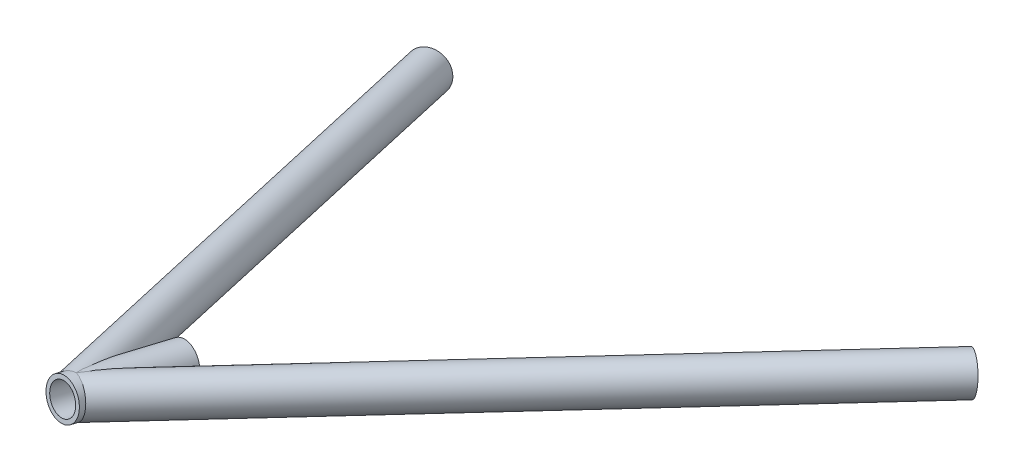
ISO-10303-21;
HEADER;
FILE_DESCRIPTION(('STEP AP214'),'2;1');
FILE_NAME('part.step','',(''),(''),'','','');
FILE_SCHEMA(('AUTOMOTIVE_DESIGN { 1 0 10303 214 1 1 1 1 }'));
ENDSEC;
DATA;
#1=APPLICATION_CONTEXT('core data for automotive mechanical design processes');
#2=APPLICATION_PROTOCOL_DEFINITION('international standard','automotive_design',2000,#1);
#3=PRODUCT_CONTEXT('',#1,'mechanical');
#4=PRODUCT('Part','Part','',(#3));
#5=PRODUCT_RELATED_PRODUCT_CATEGORY('part','',(#4));
#6=PRODUCT_DEFINITION_FORMATION('','',#4);
#7=PRODUCT_DEFINITION_CONTEXT('part definition',#1,'design');
#8=PRODUCT_DEFINITION('design','',#6,#7);
#9=PRODUCT_DEFINITION_SHAPE('','',#8);
#10=(LENGTH_UNIT() NAMED_UNIT(*) SI_UNIT(.MILLI.,.METRE.));
#11=(NAMED_UNIT(*) PLANE_ANGLE_UNIT() SI_UNIT($,.RADIAN.));
#12=(NAMED_UNIT(*) SI_UNIT($,.STERADIAN.) SOLID_ANGLE_UNIT());
#13=UNCERTAINTY_MEASURE_WITH_UNIT(LENGTH_MEASURE(1.E-05),#10,'distance_accuracy_value','');
#14=(GEOMETRIC_REPRESENTATION_CONTEXT(3) GLOBAL_UNCERTAINTY_ASSIGNED_CONTEXT((#13)) GLOBAL_UNIT_ASSIGNED_CONTEXT((#10,
#11,#12)) REPRESENTATION_CONTEXT('',''));
#15=CARTESIAN_POINT('',(0.,0.,0.));
#16=DIRECTION('',(0.,0.,1.));
#17=DIRECTION('',(1.,0.,0.));
#18=AXIS2_PLACEMENT_3D('',#15,#16,#17);
#19=CARTESIAN_POINT('',(4.04397858951075,301.981612494775,650.872201759846));
#20=DIRECTION('',(0.537160814672258,-0.118768279923982,-0.835076256915819));
#21=DIRECTION('',(-0.841029061630512,0.,-0.540989942136544));
#22=AXIS2_PLACEMENT_3D('',#19,#20,#21);
#23=CYLINDRICAL_SURFACE('',#22,7.41679999999997);
#24=CARTESIAN_POINT('',(181.199371486471,262.811887676954,375.464431215176));
#25=DIRECTION('',(-0.537160814672258,0.118768279923982,0.835076256915819));
#26=DIRECTION('',(0.841029061630512,0.,0.540989942136543));
#27=AXIS2_PLACEMENT_3D('',#24,#25,#26);
#28=CIRCLE('',#27,7.41679999999997);
#29=CARTESIAN_POINT('',(187.437115830772,262.811887676954,379.476845418014));
#30=VERTEX_POINT('',#29);
#31=EDGE_CURVE('E107',#30,#30,#28,.T.);
#32=ORIENTED_EDGE('',*,*,#31,.F.);
#33=EDGE_LOOP('',(#32));
#34=FACE_BOUND('',#33,.T.);
#35=CARTESIAN_POINT('',(18.0259893730203,297.510948456335,615.425928335186));
#36=CARTESIAN_POINT('',(18.0392009230547,297.391181249334,615.4053989557));
#37=CARTESIAN_POINT('',(18.049379106641,297.269192682269,615.394643104518));
#38=CARTESIAN_POINT('',(18.0623771955097,297.024848893247,615.395952968748));
#39=CARTESIAN_POINT('',(18.06519601463,296.902493619836,615.408022052419));
#40=CARTESIAN_POINT('',(18.0631446437854,296.662477211055,615.455138321569));
#41=CARTESIAN_POINT('',(18.0582796529336,296.544812956811,615.490169960463));
#42=CARTESIAN_POINT('',(18.0416756858454,296.317868608693,615.58008254422));
#43=CARTESIAN_POINT('',(18.0299260387503,296.208601828507,615.634994251557));
#44=CARTESIAN_POINT('',(17.9965826357287,295.968773124247,615.778938372833));
#45=CARTESIAN_POINT('',(17.9730897345507,295.841710660102,615.873266291217));
#46=CARTESIAN_POINT('',(17.9197422240915,295.603899976413,616.078980624299));
#47=CARTESIAN_POINT('',(17.8898736862353,295.493188388632,616.190404234864));
#48=CARTESIAN_POINT('',(17.8275120366974,295.291093662526,616.418282505348));
#49=CARTESIAN_POINT('',(17.7952315748672,295.199011169215,616.534187563074));
#50=CARTESIAN_POINT('',(17.7279462334323,295.025261820128,616.772888114363));
#51=CARTESIAN_POINT('',(17.692938744839,294.943605140931,616.895690174271));
#52=CARTESIAN_POINT('',(17.620894661041,294.788818403219,617.146389147038));
#53=CARTESIAN_POINT('',(17.5838530632472,294.715710889433,617.274298388449));
#54=CARTESIAN_POINT('',(17.5083523726395,294.576878159229,617.53354024883));
#55=CARTESIAN_POINT('',(17.4698939088278,294.511149718176,617.664871341302));
#56=CARTESIAN_POINT('',(17.3656042528833,294.343650096037,618.019563112275));
#57=CARTESIAN_POINT('',(17.298801180808,294.24745909781,618.24526830367));
#58=CARTESIAN_POINT('',(17.1632389097918,294.068548963037,618.701432507359));
#59=CARTESIAN_POINT('',(17.0944785846952,293.985837774328,618.931894234593));
#60=CARTESIAN_POINT('',(16.9555367997195,293.831169639357,619.396480467915));
#61=CARTESIAN_POINT('',(16.8853528544155,293.759233744994,619.630611181744));
#62=CARTESIAN_POINT('',(16.7441163542546,293.624403841432,620.101208439363));
#63=CARTESIAN_POINT('',(16.6730636982798,293.561510895916,620.337675254449));
#64=CARTESIAN_POINT('',(16.5300291670172,293.443074322862,620.813551004494));
#65=CARTESIAN_POINT('',(16.458044393262,293.387570110842,621.052968813209));
#66=CARTESIAN_POINT('',(16.3137273383495,293.28322583845,621.53314758715));
#67=CARTESIAN_POINT('',(16.2413950423059,293.234386066235,621.773908609987));
#68=CARTESIAN_POINT('',(16.0243304399387,293.096696071643,622.497142697111));
#69=CARTESIAN_POINT('',(15.8793409293532,293.016523891741,622.981195597616));
#70=CARTESIAN_POINT('',(15.563202463854,292.861599362073,624.040978545665));
#71=CARTESIAN_POINT('',(15.3921278067244,292.790531373747,624.617256246227));
#72=CARTESIAN_POINT('',(15.0517610779049,292.669278219643,625.772592750415));
#73=CARTESIAN_POINT('',(14.8824693232943,292.619096709261,626.351652022929));
#74=CARTESIAN_POINT('',(14.546667293014,292.536462920992,627.512621813292));
#75=CARTESIAN_POINT('',(14.3801608537045,292.504033411516,628.094535031451));
#76=CARTESIAN_POINT('',(14.051431917114,292.454994085379,629.260174503447));
#77=CARTESIAN_POINT('',(13.8892090857078,292.4383830313,629.843900611884));
#78=CARTESIAN_POINT('',(13.5711219110217,292.419823964543,631.010997751313));
#79=CARTESIAN_POINT('',(13.4152362896875,292.417822003584,631.594362126013));
#80=CARTESIAN_POINT('',(13.1110723780713,292.427863543567,632.763005472116));
#81=CARTESIAN_POINT('',(12.962794721003,292.439908211642,633.348284598584));
#82=CARTESIAN_POINT('',(12.6765234996167,292.478257381376,634.520275832957));
#83=CARTESIAN_POINT('',(12.5385193019929,292.504546899102,635.106985791365));
#84=CARTESIAN_POINT('',(12.3417938870989,292.555556279288,635.988619697626));
#85=CARTESIAN_POINT('',(12.277936128261,292.574486948643,636.282739578099));
#86=CARTESIAN_POINT('',(12.1542433083895,292.616487327866,636.871525918635));
#87=CARTESIAN_POINT('',(12.0944081591793,292.639556946967,637.166192366571));
#88=CARTESIAN_POINT('',(11.9600289486346,292.698749171385,637.85572611667));
#89=CARTESIAN_POINT('',(11.8873456926771,292.736648454893,638.250810467152));
#90=CARTESIAN_POINT('',(11.7525274778548,292.821778631757,639.041866355432));
#91=CARTESIAN_POINT('',(11.6903943502096,292.869011142037,639.437838035187));
#92=CARTESIAN_POINT('',(11.5794750694732,292.974727860035,640.230313522759));
#93=CARTESIAN_POINT('',(11.5306913396657,293.033214107339,640.626817414077));
#94=CARTESIAN_POINT('',(11.470343554994,293.131539272535,641.221076182981));
#95=CARTESIAN_POINT('',(11.4523665530691,293.166076993828,641.419063215714));
#96=CARTESIAN_POINT('',(11.4212609410856,293.239185884249,641.814667454382));
#97=CARTESIAN_POINT('',(11.4081320379369,293.27775680937,642.012284681955));
#98=CARTESIAN_POINT('',(11.3836671576796,293.373983487733,642.476735145353));
#99=CARTESIAN_POINT('',(11.3746116949344,293.433561302975,642.743302696478));
#100=CARTESIAN_POINT('',(11.3682948089143,293.562972324594,643.274164444859));
#101=CARTESIAN_POINT('',(11.3710346788846,293.632806654688,643.538458389653));
#102=CARTESIAN_POINT('',(11.3901826404233,293.784818610712,644.062448751672));
#103=CARTESIAN_POINT('',(11.4065623411157,293.866970307445,644.322153575299));
#104=CARTESIAN_POINT('',(11.4547428616655,294.046367314067,644.834848924092));
#105=CARTESIAN_POINT('',(11.4865364051065,294.143605487367,645.087842558034));
#106=CARTESIAN_POINT('',(11.5549147493514,294.324768047379,645.510473998685));
#107=CARTESIAN_POINT('',(11.5873322808602,294.404182129703,645.682721295324));
#108=CARTESIAN_POINT('',(11.6604911919953,294.572921566891,646.020439354004));
#109=CARTESIAN_POINT('',(11.7012298817969,294.662243714708,646.18591228517));
#110=CARTESIAN_POINT('',(11.7906581033069,294.851549362705,646.508223893678));
#111=CARTESIAN_POINT('',(11.8393406372267,294.951523452854,646.665070009299));
#112=CARTESIAN_POINT('',(11.9438288702849,295.162741771333,646.968493413005));
#113=CARTESIAN_POINT('',(11.9996345085449,295.273985903342,647.115070788835));
#114=CARTESIAN_POINT('',(12.1173731324617,295.508672974601,647.39721363735));
#115=CARTESIAN_POINT('',(12.1793428592063,295.632189055164,647.532703077649));
#116=CARTESIAN_POINT('',(12.3072756051872,295.890609327443,647.790288659604));
#117=CARTESIAN_POINT('',(12.3732387464868,296.02551386731,647.912384391545));
#118=CARTESIAN_POINT('',(12.5071009026746,296.30622592416,648.14236901447));
#119=CARTESIAN_POINT('',(12.5750012948688,296.452041324178,648.250247475103));
#120=CARTESIAN_POINT('',(12.7105107236756,296.753620990599,648.451253342594));
#121=CARTESIAN_POINT('',(12.7781197686254,296.909384970267,648.54438117432));
#122=CARTESIAN_POINT('',(12.9053835786029,297.216345003063,648.708635413285));
#123=CARTESIAN_POINT('',(12.9652297478743,297.366827559972,648.780952279324));
#124=CARTESIAN_POINT('',(13.0814750650284,297.674352647588,648.913329403656));
#125=CARTESIAN_POINT('',(13.1378744622686,297.831394702358,648.973390549331));
#126=CARTESIAN_POINT('',(13.2459558550857,298.151114517152,649.081544727949));
#127=CARTESIAN_POINT('',(13.2976378372984,298.31379229314,649.129637726989));
#128=CARTESIAN_POINT('',(13.3952051458348,298.643841112701,649.214205400618));
#129=CARTESIAN_POINT('',(13.441090135971,298.811212427783,649.250679401568));
#130=CARTESIAN_POINT('',(13.5288574832356,299.160401496814,649.314323677058));
#131=CARTESIAN_POINT('',(13.5703029443316,299.342463296291,649.340759342042));
#132=CARTESIAN_POINT('',(13.6447657558027,299.70965408605,649.381328645444));
#133=CARTESIAN_POINT('',(13.6777828414342,299.894783172485,649.395461897466));
#134=CARTESIAN_POINT('',(13.7347467915508,300.26699078181,649.411812749685));
#135=CARTESIAN_POINT('',(13.758691794149,300.454069696784,649.414027905132));
#136=CARTESIAN_POINT('',(13.7970486877606,300.828982939074,649.406868787367));
#137=CARTESIAN_POINT('',(13.8114602965379,301.01681728859,649.397494171064));
#138=CARTESIAN_POINT('',(13.8309587333078,301.401581022214,649.366666461392));
#139=CARTESIAN_POINT('',(13.8355366740282,301.598489549477,649.34462604006));
#140=CARTESIAN_POINT('',(13.8337607085808,301.9905014218,649.288295516682));
#141=CARTESIAN_POINT('',(13.8274064049574,302.185604700969,649.254004969303));
#142=CARTESIAN_POINT('',(13.8038678608829,302.572672588593,649.173332003037));
#143=CARTESIAN_POINT('',(13.7866815731982,302.764636596692,649.126947299339));
#144=CARTESIAN_POINT('',(13.7417950399094,303.144007762921,649.022179296996));
#145=CARTESIAN_POINT('',(13.7140948250639,303.331414934382,648.963796033454));
#146=CARTESIAN_POINT('',(13.6483939375111,303.702122579301,648.834406375262));
#147=CARTESIAN_POINT('',(13.6102933945019,303.88536353833,648.76328001579));
#148=CARTESIAN_POINT('',(13.5247185082023,304.244338133499,648.608757825874));
#149=CARTESIAN_POINT('',(13.477244017158,304.420071651253,648.52536180204));
#150=CARTESIAN_POINT('',(13.373992291517,304.762569288793,648.346209796664));
#151=CARTESIAN_POINT('',(13.3182153847532,304.929333762381,648.250454303173));
#152=CARTESIAN_POINT('',(13.1997162137712,305.252448661401,648.046472659108));
#153=CARTESIAN_POINT('',(13.1369941772474,305.408799427974,647.938246917363));
#154=CARTESIAN_POINT('',(13.0079807472715,305.705736241056,647.712250351754));
#155=CARTESIAN_POINT('',(12.9418256091205,305.846627647483,647.59480319643));
#156=CARTESIAN_POINT('',(12.8063252704746,306.115959344151,647.348055863197));
#157=CARTESIAN_POINT('',(12.7369801487349,306.244399941537,647.218755977834));
#158=CARTESIAN_POINT('',(12.5972245605859,306.487624851574,646.948669395698));
#159=CARTESIAN_POINT('',(12.5268151987456,306.602422356299,646.807894020864));
#160=CARTESIAN_POINT('',(12.3870749633705,306.817660822114,646.515272129223));
#161=CARTESIAN_POINT('',(12.3177440058268,306.91810290655,646.363426480097));
#162=CARTESIAN_POINT('',(12.187204266398,307.097517916396,646.060748085196));
#163=CARTESIAN_POINT('',(12.1257689621684,307.177511507652,645.910616592422));
#164=CARTESIAN_POINT('',(12.0073617238849,307.324690296442,645.602541218296));
#165=CARTESIAN_POINT('',(11.9503894179186,307.391876561913,645.444597989707));
#166=CARTESIAN_POINT('',(11.8422612739717,307.513782780615,645.122088728321));
#167=CARTESIAN_POINT('',(11.7911047326352,307.568504242139,644.957523499652));
#168=CARTESIAN_POINT('',(11.6955621068052,307.666185719994,644.623031226127));
#169=CARTESIAN_POINT('',(11.6511769529345,307.709144120317,644.453103448139));
#170=CARTESIAN_POINT('',(11.5562273899794,307.796714592838,644.052034572754));
#171=CARTESIAN_POINT('',(11.508504229024,307.83714011634,643.819301773671));
#172=CARTESIAN_POINT('',(11.426372932171,307.901437123905,643.349259932401));
#173=CARTESIAN_POINT('',(11.3919700818443,307.925302039599,643.111949112764));
#174=CARTESIAN_POINT('',(11.3357964940907,307.959215673984,642.63434225165));
#175=CARTESIAN_POINT('',(11.3140562593375,307.96923111001,642.394040414363));
#176=CARTESIAN_POINT('',(11.2822138290264,307.977808650157,641.912553650223));
#177=CARTESIAN_POINT('',(11.2721103959542,307.97637197228,641.67136882001));
#178=CARTESIAN_POINT('',(11.2609650047204,307.9626033566,641.127982475222));
#179=CARTESIAN_POINT('',(11.2628654957441,307.947604593592,640.825795463397));
#180=CARTESIAN_POINT('',(11.2803047822254,307.906164362887,640.222546893591));
#181=CARTESIAN_POINT('',(11.2958500310743,307.879717483717,639.921485935857));
#182=CARTESIAN_POINT('',(11.3383398883103,307.817706795311,639.320600353298));
#183=CARTESIAN_POINT('',(11.3653050759216,307.782126573212,639.02077895199));
#184=CARTESIAN_POINT('',(11.4287010459255,307.703622419329,638.42318343931));
#185=CARTESIAN_POINT('',(11.4651303890478,307.660699604515,638.125409023702));
#186=CARTESIAN_POINT('',(11.5462096236828,307.568378875036,637.529410987154));
#187=CARTESIAN_POINT('',(11.5909257767127,307.518929765035,637.231204472079));
#188=CARTESIAN_POINT('',(11.6870548657426,307.414766469799,636.636803034188));
#189=CARTESIAN_POINT('',(11.7384679733657,307.360052149641,636.340608163129));
#190=CARTESIAN_POINT('',(11.8468591948296,307.24609197885,635.750486583504));
#191=CARTESIAN_POINT('',(11.9038308719929,307.186851386371,635.456557666955));
#192=CARTESIAN_POINT('',(12.0225233012161,307.064259457315,634.870528460908));
#193=CARTESIAN_POINT('',(12.0842440531249,307.000908120869,634.578428171352));
#194=CARTESIAN_POINT('',(12.2184611596817,306.863538311854,633.965181365808));
#195=CARTESIAN_POINT('',(12.2914069656672,306.789100061657,633.644227508919));
#196=CARTESIAN_POINT('',(12.441461988527,306.635913534411,633.004324054833));
#197=CARTESIAN_POINT('',(12.5185713428966,306.557165115023,632.685374524215));
#198=CARTESIAN_POINT('',(12.7551826990239,306.314740685158,631.731315983409));
#199=CARTESIAN_POINT('',(12.9199521729491,306.144901487568,631.099067891332));
#200=CARTESIAN_POINT('',(13.2599677612956,305.788975297079,629.840756650357));
#201=CARTESIAN_POINT('',(13.4352318327593,305.602860189012,629.214706369674));
#202=CARTESIAN_POINT('',(13.7932579710048,305.214016232643,627.970038393295));
#203=CARTESIAN_POINT('',(13.9760191405481,305.011289369524,627.351419819577));
#204=CARTESIAN_POINT('',(14.3452017680405,304.589678406339,626.128069053151));
#205=CARTESIAN_POINT('',(14.5315701650489,304.370971109374,625.523260275809));
#206=CARTESIAN_POINT('',(14.8139307637117,304.02745668686,624.6227274501));
#207=CARTESIAN_POINT('',(14.9085343518049,303.910356292052,624.323615826375));
#208=CARTESIAN_POINT('',(15.0984779122026,303.670518834585,623.727900343464));
#209=CARTESIAN_POINT('',(15.1938178634639,303.547781932507,623.431296413119));
#210=CARTESIAN_POINT('',(15.3848279575733,303.296351351947,622.841565050507));
#211=CARTESIAN_POINT('',(15.480496914537,303.167671355233,622.548431411254));
#212=CARTESIAN_POINT('',(15.6721587563683,302.903352225973,621.965436136662));
#213=CARTESIAN_POINT('',(15.7681516240351,302.767713457694,621.675574331022));
#214=CARTESIAN_POINT('',(15.9601786521053,302.488559756385,621.099861321316));
#215=CARTESIAN_POINT('',(16.0562127698196,302.345048680094,620.814008238013));
#216=CARTESIAN_POINT('',(16.2480657583436,302.048824611076,620.247057412478));
#217=CARTESIAN_POINT('',(16.3438846562762,301.896112854182,619.965959038063));
#218=CARTESIAN_POINT('',(16.5007724105263,301.636276128116,619.509191365899));
#219=CARTESIAN_POINT('',(16.5620197729741,301.532368346773,619.331752716318));
#220=CARTESIAN_POINT('',(16.6841330910256,301.31939311484,618.979814257614));
#221=CARTESIAN_POINT('',(16.7449989877478,301.210324888888,618.805314895497));
#222=CARTESIAN_POINT('',(16.8664289891661,300.98577901384,618.459144789293));
#223=CARTESIAN_POINT('',(16.9269904759811,300.870274557181,618.287490448721));
#224=CARTESIAN_POINT('',(17.0472615114838,300.63234713766,617.948769242178));
#225=CARTESIAN_POINT('',(17.1069712313438,300.509925590115,617.781701448066));
#226=CARTESIAN_POINT('',(17.2258774278961,300.25536827208,617.451488817069));
#227=CARTESIAN_POINT('',(17.2850595415654,300.123134945401,617.288413504024));
#228=CARTESIAN_POINT('',(17.4016610311343,299.848347429108,616.97013954836));
#229=CARTESIAN_POINT('',(17.4590786464364,299.705783379173,616.81494867798));
#230=CARTESIAN_POINT('',(17.5708662190597,299.408832466774,616.516614372798));
#231=CARTESIAN_POINT('',(17.6252497345914,299.254506976522,616.373415617786));
#232=CARTESIAN_POINT('',(17.7295842627494,298.930641743062,616.103831748072));
#233=CARTESIAN_POINT('',(17.7795458072694,298.761140196122,615.977406304535));
#234=CARTESIAN_POINT('',(17.86111838538,298.446195118441,615.777748005667));
#235=CARTESIAN_POINT('',(17.8942611916319,298.304685323759,615.69902386072));
#236=CARTESIAN_POINT('',(17.953971389663,298.010431036427,615.563990476506));
#237=CARTESIAN_POINT('',(17.9805769467949,297.857758849595,615.507549908532));
#238=CARTESIAN_POINT('',(18.0110423998854,297.638002947985,615.450592182051));
#239=CARTESIAN_POINT('',(18.0189468529607,297.574791302601,615.43687168146));
#240=CARTESIAN_POINT('',(18.0259893730203,297.510948456335,615.425928335186));
#241=B_SPLINE_CURVE_WITH_KNOTS('',3,(#35,#36,#37,#38,#39,#40,#41,#42,#43,#44,#45,#46,#47,#48,
#49,#50,#51,#52,#53,#54,#55,#56,#57,#58,#59,#60,#61,#62,#63,#64,#65,#66,#67,#68,#69,#70,#71,#72,
#73,#74,#75,#76,#77,#78,#79,#80,#81,#82,#83,#84,#85,#86,#87,#88,#89,#90,#91,#92,#93,#94,#95,#96,
#97,#98,#99,#100,#101,#102,#103,#104,#105,#106,#107,#108,#109,#110,#111,#112,#113,#114,#115,
#116,#117,#118,#119,#120,#121,#122,#123,#124,#125,#126,#127,#128,#129,#130,#131,#132,#133,#134,
#135,#136,#137,#138,#139,#140,#141,#142,#143,#144,#145,#146,#147,#148,#149,#150,#151,#152,#153,
#154,#155,#156,#157,#158,#159,#160,#161,#162,#163,#164,#165,#166,#167,#168,#169,#170,#171,#172,
#173,#174,#175,#176,#177,#178,#179,#180,#181,#182,#183,#184,#185,#186,#187,#188,#189,#190,#191,
#192,#193,#194,#195,#196,#197,#198,#199,#200,#201,#202,#203,#204,#205,#206,#207,#208,#209,#210,
#211,#212,#213,#214,#215,#216,#217,#218,#219,#220,#221,#222,#223,#224,#225,#226,#227,#228,#229,
#230,#231,#232,#233,#234,#235,#236,#237,#238,#239,#240),.UNSPECIFIED.,.T.,.F.,(4,2,2,2,2,2,2,2,
2,2,2,2,2,2,2,2,2,2,2,2,2,2,2,2,2,2,2,2,2,2,2,2,2,2,2,2,2,2,2,2,2,2,2,2,2,2,2,2,2,2,2,2,2,2,2,2,
2,2,2,2,2,2,2,2,2,2,2,2,2,2,2,2,2,2,2,2,2,2,2,2,2,2,2,2,2,2,2,2,2,2,2,2,2,2,2,2,2,2,2,2,2,2,4),
(0.,0.366426411934708,0.73290690135951,1.09913952450715,1.46594129632992,1.94322967318515,
2.42157163259857,2.87542474857674,3.32971753530915,3.78518252473583,4.24044769595332,
5.00268399978702,5.76536811281952,6.52952338794362,7.2937684739434,8.06193971685634,
8.8301441636213,10.364533379538,12.1800531532704,13.995890532235,15.8140514484965,
17.6320701251144,19.4433718311585,21.2548240488184,23.0643745169353,23.9690296120688,
24.8736648704264,26.0839476972957,27.2944403825808,28.5051526601129,29.1104085392524,
29.7156278218809,30.535125126655,31.3547122837529,32.1725977478725,32.9900974880185,
33.5668858956185,34.1434881498791,34.7195851863437,35.2956772994776,35.8754363865321,
36.455213203531,37.0354130275454,37.6155961367506,38.1470940861742,38.6785535386266,
39.210014496625,39.741506261734,40.3066237532496,40.8717589934907,41.4370101551506,
42.0022780503297,42.5961565976837,43.1900567366995,43.7840691558873,44.3780798372981,
44.9780084278713,45.5779464753879,46.1778608397589,46.7777555419164,47.3619607313538,
47.9461515055129,48.5297727244397,49.113348248606,49.6552714107253,50.1971493649192,
50.7389617147667,51.28084846142,52.0026521151869,52.7247418917162,53.448563975134,
54.1723090766559,55.0793243153878,55.9867687651245,56.8958554742071,57.8048040139135,
58.7213613670174,59.6379422133901,60.5534740034783,61.4690057644014,62.4812912474417,
63.4936101802627,65.5184709728118,67.5469013609829,69.5750896946762,71.5835033619183,
72.5880322542247,73.5925325455868,74.5948255935203,75.59706622851,76.5988201644497,
77.6004398438126,78.2440285653986,78.8877142959967,79.534317235536,80.1807883483635,
80.8348853894417,81.4896151826048,82.1411359346856,82.7910606644522,83.2856362245701,
83.7772518556355,83.9725783199543),.UNSPECIFIED.);
#242=CARTESIAN_POINT('',(18.0259893730203,297.510948456335,615.425928335186));
#243=VERTEX_POINT('',#242);
#244=EDGE_CURVE('E81',#243,#243,#241,.T.);
#245=ORIENTED_EDGE('',*,*,#244,.T.);
#246=EDGE_LOOP('',(#245));
#247=FACE_BOUND('',#246,.T.);
#248=ADVANCED_FACE('F63',(#34,#247),#23,.F.);
#249=CARTESIAN_POINT('',(10.1712188766484,294.809656352147,601.770063603224));
#250=DIRECTION('',(-0.122544805742753,0.143439122852553,0.982042763132422));
#251=DIRECTION('',(0.,-0.989500647349858,0.144528436282319));
#252=AXIS2_PLACEMENT_3D('',#249,#250,#251);
#253=CYLINDRICAL_SURFACE('',#252,9.52500000000002);
#254=ORIENTED_EDGE('',*,*,#244,.F.);
#255=EDGE_LOOP('',(#254));
#256=FACE_BOUND('',#255,.T.);
#257=CARTESIAN_POINT('',(4.04397858951081,301.981612494775,650.872201759846));
#258=DIRECTION('',(0.941060120574561,0.0559957790365611,0.333572064469255));
#259=DIRECTION('',(0.338160058557685,-0.134405510478131,-0.931441320507833));
#260=AXIS2_PLACEMENT_3D('',#257,#258,#259);
#261=ELLIPSE('',#260,43.2380682628043,9.52500000000002);
#262=CARTESIAN_POINT('',(3.97422835979852,311.405104857805,649.487083862563));
#263=VERTEX_POINT('',#262);
#264=CARTESIAN_POINT('',(4.1137288192231,292.558120131745,652.257319657128));
#265=VERTEX_POINT('',#264);
#266=EDGE_CURVE('E72',#263,#265,#261,.F.);
#267=ORIENTED_EDGE('',*,*,#266,.T.);
#268=CARTESIAN_POINT('',(4.04397858951081,301.981612494775,650.872201759846));
#269=DIRECTION('',(0.338160058557685,-0.134405510478131,-0.931441320507833));
#270=DIRECTION('',(0.941060120574561,0.0559957790365611,0.333572064469255));
#271=AXIS2_PLACEMENT_3D('',#268,#269,#270);
#272=ELLIPSE('',#271,9.76488439111886,9.52500000000002);
#273=EDGE_CURVE('E13',#265,#263,#272,.F.);
#274=ORIENTED_EDGE('',*,*,#273,.T.);
#275=EDGE_LOOP('',(#267,#274));
#276=FACE_BOUND('',#275,.T.);
#277=ADVANCED_FACE('F79',(#256,#276),#253,.F.);
#278=CARTESIAN_POINT('',(4.04397858951075,301.981612494775,650.872201759846));
#279=DIRECTION('',(0.537160814672258,-0.118768279923982,-0.835076256915819));
#280=DIRECTION('',(-0.841029061630512,0.,-0.540989942136544));
#281=AXIS2_PLACEMENT_3D('',#278,#279,#280);
#282=CYLINDRICAL_SURFACE('',#281,9.52500000000003);
#283=CARTESIAN_POINT('',(181.199371486471,262.811887676954,375.464431215176));
#284=DIRECTION('',(-0.537160814672258,0.118768279923982,0.835076256915819));
#285=DIRECTION('',(0.841029061630512,0.,0.540989942136543));
#286=AXIS2_PLACEMENT_3D('',#283,#284,#285);
#287=CIRCLE('',#286,9.52500000000003);
#288=CARTESIAN_POINT('',(189.210173298502,262.811887676954,380.617360414027));
#289=VERTEX_POINT('',#288);
#290=EDGE_CURVE('E67',#289,#289,#287,.T.);
#291=ORIENTED_EDGE('',*,*,#290,.T.);
#292=EDGE_LOOP('',(#291));
#293=FACE_BOUND('',#292,.T.);
#294=ORIENTED_EDGE('',*,*,#266,.F.);
#295=ORIENTED_EDGE('',*,*,#273,.F.);
#296=EDGE_LOOP('',(#294,#295));
#297=FACE_BOUND('',#296,.T.);
#298=ADVANCED_FACE('F65',(#293,#297),#282,.T.);
#299=CARTESIAN_POINT('',(181.199371486471,262.811887676954,375.464431215176));
#300=DIRECTION('',(-0.537160814672258,0.118768279923982,0.835076256915819));
#301=DIRECTION('',(0.841029061630512,0.,0.540989942136543));
#302=AXIS2_PLACEMENT_3D('',#299,#300,#301);
#303=PLANE('',#302);
#304=ORIENTED_EDGE('',*,*,#31,.T.);
#305=EDGE_LOOP('',(#304));
#306=FACE_BOUND('',#305,.T.);
#307=ORIENTED_EDGE('',*,*,#290,.F.);
#308=EDGE_LOOP('',(#307));
#309=FACE_BOUND('',#308,.T.);
#310=ADVANCED_FACE('F84',(#306,#309),#303,.F.);
#311=CLOSED_SHELL('',(#248,#277,#298,#310));
#312=MANIFOLD_SOLID_BREP('B2',#311);
#313=CARTESIAN_POINT('',(-99.9999999999999,256.434476218686,346.236762223122));
#314=DIRECTION('',(0.320018024842971,0.140093687168908,0.936996383446075));
#315=DIRECTION('',(0.946328839633178,0.,-0.323205394878431));
#316=AXIS2_PLACEMENT_3D('',#313,#314,#315);
#317=CYLINDRICAL_SURFACE('',#316,7.41679999999997);
#318=CARTESIAN_POINT('',(-88.7993691304959,261.337755269598,379.031635643735));
#319=DIRECTION('',(0.320018024842971,0.140093687168908,0.936996383446075));
#320=DIRECTION('',(0.946328839633178,0.,-0.323205394878431));
#321=AXIS2_PLACEMENT_3D('',#318,#319,#320);
#322=CIRCLE('',#321,7.41679999999997);
#323=CARTESIAN_POINT('',(-81.7806373927046,261.337755269598,376.634485871));
#324=VERTEX_POINT('',#323);
#325=EDGE_CURVE('E189',#324,#324,#322,.T.);
#326=ORIENTED_EDGE('',*,*,#325,.F.);
#327=EDGE_LOOP('',(#326));
#328=FACE_BOUND('',#327,.T.);
#329=CARTESIAN_POINT('',(-0.888888857109953,296.749583461002,613.48138180967));
#330=CARTESIAN_POINT('',(-0.888560553987267,296.825460430329,613.482344738953));
#331=CARTESIAN_POINT('',(-0.887902174840742,296.901312382579,613.487806639));
#332=CARTESIAN_POINT('',(-0.885981385085939,297.0519732914,613.507035260747));
#333=CARTESIAN_POINT('',(-0.884718258848478,297.126780903932,613.520811826676));
#334=CARTESIAN_POINT('',(-0.880117404144003,297.349259178406,613.57337974887));
#335=CARTESIAN_POINT('',(-0.875972144200541,297.494325132679,613.623386674901));
#336=CARTESIAN_POINT('',(-0.867659731153033,297.731941777742,613.726506202707));
#337=CARTESIAN_POINT('',(-0.863879961500112,297.827083751218,613.774084356514));
#338=CARTESIAN_POINT('',(-0.85575358963688,298.01275211883,613.877520145806));
#339=CARTESIAN_POINT('',(-0.851406913154636,298.103277906023,613.933378866281));
#340=CARTESIAN_POINT('',(-0.842277327003536,298.279974437861,614.051657215357));
#341=CARTESIAN_POINT('',(-0.83749401223167,298.36614102057,614.114082945033));
#342=CARTESIAN_POINT('',(-0.827596191122819,298.534395900238,614.24411119319));
#343=CARTESIAN_POINT('',(-0.822481759214172,298.616485106427,614.311712548917));
#344=CARTESIAN_POINT('',(-0.810120441346757,298.805728366098,614.476046670399));
#345=CARTESIAN_POINT('',(-0.802765516547744,298.911337097892,614.574545760657));
#346=CARTESIAN_POINT('',(-0.787721430675265,299.11672057491,614.777452571634));
#347=CARTESIAN_POINT('',(-0.78003212693174,299.21649278642,614.88186282033));
#348=CARTESIAN_POINT('',(-0.764406658785229,299.411089537504,615.095462712776));
#349=CARTESIAN_POINT('',(-0.756470121981084,299.505905973855,615.20465967845));
#350=CARTESIAN_POINT('',(-0.740432095982114,299.691070914465,615.426777349389));
#351=CARTESIAN_POINT('',(-0.732330576810755,299.781418596361,615.539698733716));
#352=CARTESIAN_POINT('',(-0.707775456252871,300.047522479253,615.884211101211));
#353=CARTESIAN_POINT('',(-0.691155103477002,300.217323187595,616.120405928881));
#354=CARTESIAN_POINT('',(-0.666136525066289,300.462451252219,616.480884798047));
#355=CARTESIAN_POINT('',(-0.65778629047552,300.54252952627,616.602016829441));
#356=CARTESIAN_POINT('',(-0.641077262048758,300.699837161769,616.846121880463));
#357=CARTESIAN_POINT('',(-0.632718468271695,300.777066542696,616.969094887494));
#358=CARTESIAN_POINT('',(-0.609244930777645,300.990522686071,617.316970545332));
#359=CARTESIAN_POINT('',(-0.594147494494951,301.123814299998,617.543675871678));
#360=CARTESIAN_POINT('',(-0.56411243942792,301.38321135413,618.001188105067));
#361=CARTESIAN_POINT('',(-0.549174842713218,301.509315812117,618.231995567092));
#362=CARTESIAN_POINT('',(-0.519543631648266,301.755331995766,618.697031421875));
#363=CARTESIAN_POINT('',(-0.50485013234134,301.87524085464,618.931261335071));
#364=CARTESIAN_POINT('',(-0.475791718337932,302.109547749807,619.402486986824));
#365=CARTESIAN_POINT('',(-0.46142682133973,302.223945489642,619.639482873322));
#366=CARTESIAN_POINT('',(-0.418870748030325,302.56028083409,620.355007757066));
#367=CARTESIAN_POINT('',(-0.39128353897405,302.774828924035,620.837054437175));
#368=CARTESIAN_POINT('',(-0.338280564760777,303.187667003892,621.807973708428));
#369=CARTESIAN_POINT('',(-0.312864269700514,303.385960960832,622.296844599742));
#370=CARTESIAN_POINT('',(-0.26472459311584,303.769054300666,623.281097589358));
#371=CARTESIAN_POINT('',(-0.242006731479774,303.953825735595,623.776490807331));
#372=CARTESIAN_POINT('',(-0.199989673853791,304.311051699945,624.771864670681));
#373=CARTESIAN_POINT('',(-0.180690696704232,304.483505440498,625.271845607562));
#374=CARTESIAN_POINT('',(-0.146341991800403,304.816935214612,626.275018219416));
#375=CARTESIAN_POINT('',(-0.13128663463133,304.977926240102,626.778204726653));
#376=CARTESIAN_POINT('',(-0.106391230308692,305.289329675297,627.787949723642));
#377=CARTESIAN_POINT('',(-0.096550967662725,305.439742521879,628.294508073191));
#378=CARTESIAN_POINT('',(-0.0853684736291246,305.686439714581,629.157433281865));
#379=CARTESIAN_POINT('',(-0.0823584143787302,305.785368462441,629.513025074534));
#380=CARTESIAN_POINT('',(-0.0800743997030252,305.978151625632,630.225591852354));
#381=CARTESIAN_POINT('',(-0.0808003884669962,306.072006116742,630.582566816762));
#382=CARTESIAN_POINT('',(-0.0866667842991458,306.254558424456,631.298060797291));
#383=CARTESIAN_POINT('',(-0.0918102159345305,306.343252663464,631.656580703831));
#384=CARTESIAN_POINT('',(-0.107355674093121,306.515122406717,632.374828333296));
#385=CARTESIAN_POINT('',(-0.117757623501202,306.598297991873,632.73455603843));
#386=CARTESIAN_POINT('',(-0.144803468445097,306.758266856524,633.453381404091));
#387=CARTESIAN_POINT('',(-0.161417037538046,306.835088965133,633.812473744721));
#388=CARTESIAN_POINT('',(-0.202193268938213,306.982078219575,634.531637371896));
#389=CARTESIAN_POINT('',(-0.226356536929949,307.052244830874,634.891708734688));
#390=CARTESIAN_POINT('',(-0.283853260628612,307.184775153349,635.612239634208));
#391=CARTESIAN_POINT('',(-0.317178485097451,307.24714579572,635.972698534584));
#392=CARTESIAN_POINT('',(-0.395080477788453,307.362563013775,636.69386126582));
#393=CARTESIAN_POINT('',(-0.439654600973957,307.415611776415,637.05456501925));
#394=CARTESIAN_POINT('',(-0.527132280561848,307.495771738488,637.666704013242));
#395=CARTESIAN_POINT('',(-0.566477778083724,307.525878491294,637.918252622468));
#396=CARTESIAN_POINT('',(-0.653009420795055,307.579272711413,638.420756271467));
#397=CARTESIAN_POINT('',(-0.700195731429062,307.602560034805,638.671711298602));
#398=CARTESIAN_POINT('',(-0.803701798521187,307.640903858027,639.172921324412));
#399=CARTESIAN_POINT('',(-0.860039552482629,307.655943878103,639.423173934549));
#400=CARTESIAN_POINT('',(-0.983064926419874,307.675833622747,639.921587348852));
#401=CARTESIAN_POINT('',(-1.04975282735485,307.680683070636,640.16974809604));
#402=CARTESIAN_POINT('',(-1.19590124951656,307.677782199941,640.666692423633));
#403=CARTESIAN_POINT('',(-1.27555282354648,307.669824521426,640.915419814708));
#404=CARTESIAN_POINT('',(-1.44782829592942,307.637869484295,641.407411317305));
#405=CARTESIAN_POINT('',(-1.54045298350615,307.613871149506,641.650675095401));
#406=CARTESIAN_POINT('',(-1.73852287224344,307.546529592693,642.128117945089));
#407=CARTESIAN_POINT('',(-1.84391501021676,307.50326456508,642.362329620607));
#408=CARTESIAN_POINT('',(-2.06677817059399,307.394011843155,642.819422919151));
#409=CARTESIAN_POINT('',(-2.18424136414095,307.328038812016,643.042311747323));
#410=CARTESIAN_POINT('',(-2.39026505627518,307.195347911126,643.40597414377));
#411=CARTESIAN_POINT('',(-2.47636472277949,307.135326133523,643.550614076489));
#412=CARTESIAN_POINT('',(-2.65163884248032,307.00278276242,643.832094881923));
#413=CARTESIAN_POINT('',(-2.74081282428156,306.930263078507,643.968936941851));
#414=CARTESIAN_POINT('',(-2.92067577294864,306.772502863549,644.234146990977));
#415=CARTESIAN_POINT('',(-3.01136546941876,306.687256039829,644.362510742707));
#416=CARTESIAN_POINT('',(-3.19244356391282,306.504250109581,644.610226776026));
#417=CARTESIAN_POINT('',(-3.28283194663875,306.406490377394,644.729578606536));
#418=CARTESIAN_POINT('',(-3.46139709738542,306.199086290725,644.958931597354));
#419=CARTESIAN_POINT('',(-3.5495762546032,306.089455523805,645.068943196354));
#420=CARTESIAN_POINT('',(-3.72212151586972,305.85896678086,645.279801815299));
#421=CARTESIAN_POINT('',(-3.80648760076554,305.73810874845,645.380648789214));
#422=CARTESIAN_POINT('',(-3.96990052789728,305.486021132181,645.573421691661));
#423=CARTESIAN_POINT('',(-4.04894497249053,305.354786930519,645.665343607183));
#424=CARTESIAN_POINT('',(-4.20033278115582,305.083000892509,645.840513356375));
#425=CARTESIAN_POINT('',(-4.27267596860403,304.94244881074,645.923760961424));
#426=CARTESIAN_POINT('',(-4.4113415101626,304.64924619321,646.084007158328));
#427=CARTESIAN_POINT('',(-4.47745343714375,304.496373717142,646.160781612766));
#428=CARTESIAN_POINT('',(-4.60041333294139,304.183083669716,646.305876256255));
#429=CARTESIAN_POINT('',(-4.65726121483206,304.02266602758,646.374196365976));
#430=CARTESIAN_POINT('',(-4.7608932471625,303.695429173802,646.50267772907));
#431=CARTESIAN_POINT('',(-4.80767668127643,303.528609507498,646.562838401593));
#432=CARTESIAN_POINT('',(-4.89055534779395,303.189716194653,646.675216549686));
#433=CARTESIAN_POINT('',(-4.92664990692588,303.017642217904,646.727433524798));
#434=CARTESIAN_POINT('',(-4.98975254120468,302.657598195263,646.827324537186));
#435=CARTESIAN_POINT('',(-5.01598182497538,302.469339701804,646.874453183785));
#436=CARTESIAN_POINT('',(-5.05536336846064,302.089474408237,646.959865053435));
#437=CARTESIAN_POINT('',(-5.06851506236413,301.89786746362,646.998147893712));
#438=CARTESIAN_POINT('',(-5.08155772404986,301.512598155235,647.065811346509));
#439=CARTESIAN_POINT('',(-5.08144586866829,301.318935362648,647.09519006244));
#440=CARTESIAN_POINT('',(-5.0679467668633,300.9309111797,647.144852781192));
#441=CARTESIAN_POINT('',(-5.05455968537551,300.736549798049,647.165136897001));
#442=CARTESIAN_POINT('',(-5.0142013695595,300.343780294466,647.196684548385));
#443=CARTESIAN_POINT('',(-4.98691345584822,300.145386341017,647.207721164155));
#444=CARTESIAN_POINT('',(-4.91897292070895,299.750585080077,647.219497932184));
#445=CARTESIAN_POINT('',(-4.87831998747224,299.554177819045,647.2202378442));
#446=CARTESIAN_POINT('',(-4.78423151885551,299.164672724184,647.210842306118));
#447=CARTESIAN_POINT('',(-4.73079373919296,298.971575477788,647.200704945506));
#448=CARTESIAN_POINT('',(-4.61196337910778,298.590067809978,647.168853346183));
#449=CARTESIAN_POINT('',(-4.54657099918354,298.401657310021,647.14713930162));
#450=CARTESIAN_POINT('',(-4.40565239545024,298.032771892183,647.09162361686));
#451=CARTESIAN_POINT('',(-4.33023854123984,297.852234856018,647.057949932369));
#452=CARTESIAN_POINT('',(-4.1700973588098,297.49830346668,646.977640314663));
#453=CARTESIAN_POINT('',(-4.08537002916163,297.324909114603,646.93100437946));
#454=CARTESIAN_POINT('',(-3.90831084157144,296.986618385109,646.823972024722));
#455=CARTESIAN_POINT('',(-3.81598482221728,296.821715638514,646.763586108348));
#456=CARTESIAN_POINT('',(-3.62563133773704,296.501428161254,646.628296870462));
#457=CARTESIAN_POINT('',(-3.52760430601707,296.346042708898,646.55339465151));
#458=CARTESIAN_POINT('',(-3.33380000998979,296.054398153577,646.393287603787));
#459=CARTESIAN_POINT('',(-3.23821459823516,295.917553448388,646.308916753364));
#460=CARTESIAN_POINT('',(-3.0460144386148,295.653919589249,646.126718963716));
#461=CARTESIAN_POINT('',(-2.94939975756301,295.527129787054,646.028892893072));
#462=CARTESIAN_POINT('',(-2.75725078541577,295.284099998638,645.820116604834));
#463=CARTESIAN_POINT('',(-2.6617160478686,295.167855502076,645.709172045375));
#464=CARTESIAN_POINT('',(-2.47361905580619,294.94599506004,645.474849572501));
#465=CARTESIAN_POINT('',(-2.38105678445252,294.840379054351,645.351471729535));
#466=CARTESIAN_POINT('',(-2.2054267102107,294.645023146032,645.100398897055));
#467=CARTESIAN_POINT('',(-2.12211619121558,294.554733274032,644.973299324937));
#468=CARTESIAN_POINT('',(-1.96064402862068,294.383070637995,644.710160871711));
#469=CARTESIAN_POINT('',(-1.88248214489826,294.301697457983,644.574122408089));
#470=CARTESIAN_POINT('',(-1.73195820830292,294.147246070053,644.294360500298));
#471=CARTESIAN_POINT('',(-1.65959647570565,294.074168320103,644.150636632482));
#472=CARTESIAN_POINT('',(-1.52097734498237,293.935578918412,643.856759409942));
#473=CARTESIAN_POINT('',(-1.45472065019741,293.870068138217,643.706605317325));
#474=CARTESIAN_POINT('',(-1.27739381337507,293.695715635214,643.277782390636));
#475=CARTESIAN_POINT('',(-1.17326299984241,293.59452363995,642.993105910046));
#476=CARTESIAN_POINT('',(-0.983623663624922,293.409779862737,642.412054630301));
#477=CARTESIAN_POINT('',(-0.898130973784337,293.326243080489,642.115670135814));
#478=CARTESIAN_POINT('',(-0.743040308486885,293.172765639168,641.513796028546));
#479=CARTESIAN_POINT('',(-0.673520318998667,293.102891926363,641.208269644251));
#480=CARTESIAN_POINT('',(-0.579686866808886,293.006503430365,640.746259160588));
#481=CARTESIAN_POINT('',(-0.5501533831579,292.975781149339,640.591656397941));
#482=CARTESIAN_POINT('',(-0.494264828980689,292.916852691036,640.2813972187));
#483=CARTESIAN_POINT('',(-0.467909758162906,292.888646513528,640.125740802201));
#484=CARTESIAN_POINT('',(-0.400921733251907,292.815818206477,639.705918187734));
#485=CARTESIAN_POINT('',(-0.362978459149125,292.773291684048,639.44095828826));
#486=CARTESIAN_POINT('',(-0.29417870671403,292.693708837337,638.909286704363));
#487=CARTESIAN_POINT('',(-0.263323265542843,292.656653313908,638.642574769431));
#488=CARTESIAN_POINT('',(-0.207679111913715,292.587261476901,638.107775242082));
#489=CARTESIAN_POINT('',(-0.182893515175709,292.554927590417,637.83968701498));
#490=CARTESIAN_POINT('',(-0.138561610992253,292.494443931853,637.302600975976));
#491=CARTESIAN_POINT('',(-0.119015630886719,292.466294421237,637.033603108308));
#492=CARTESIAN_POINT('',(-0.067056926805701,292.387343972981,636.224439928549));
#493=CARTESIAN_POINT('',(-0.0414388820729345,292.342189294265,635.683280963866));
#494=CARTESIAN_POINT('',(-0.00383959829984731,292.264693681795,634.599790283728));
#495=CARTESIAN_POINT('',(0.00814525921661797,292.232349349447,634.057458917753));
#496=CARTESIAN_POINT('',(0.0216239340768103,292.179287427782,632.971014722864));
#497=CARTESIAN_POINT('',(0.023096527487623,292.158593437643,632.42690050767));
#498=CARTESIAN_POINT('',(0.0177836980870559,292.128498437963,631.338378641259));
#499=CARTESIAN_POINT('',(0.0109977568436658,292.11909813746,630.793970973766));
#500=CARTESIAN_POINT('',(-0.00912968570361563,292.111698171095,629.705939958849));
#501=CARTESIAN_POINT('',(-0.0224623109531336,292.113683107836,629.162316546206));
#502=CARTESIAN_POINT('',(-0.0544037968859862,292.129568190291,628.075411952207));
#503=CARTESIAN_POINT('',(-0.0730124668891094,292.143467905433,627.532130759194));
#504=CARTESIAN_POINT('',(-0.108213257707944,292.178021470981,626.61130394876));
#505=CARTESIAN_POINT('',(-0.123698340834104,292.195336968865,626.233588429212));
#506=CARTESIAN_POINT('',(-0.156478467630256,292.23674995377,625.478610051085));
#507=CARTESIAN_POINT('',(-0.173773481817102,292.260847330327,625.101347185233));
#508=CARTESIAN_POINT('',(-0.209910144665081,292.316441298362,624.347980677794));
#509=CARTESIAN_POINT('',(-0.228749534623364,292.347927205183,623.971876149414));
#510=CARTESIAN_POINT('',(-0.267786427746542,292.419187574126,623.22055105797));
#511=CARTESIAN_POINT('',(-0.287983843085084,292.458961500593,622.845330439363));
#512=CARTESIAN_POINT('',(-0.337622383131653,292.565177830241,621.95050133339));
#513=CARTESIAN_POINT('',(-0.367606817431555,292.635978142451,621.431418048787));
#514=CARTESIAN_POINT('',(-0.413904099502073,292.759023984689,620.655626443556));
#515=CARTESIAN_POINT('',(-0.4295546890861,292.802840605619,620.397532036975));
#516=CARTESIAN_POINT('',(-0.461234752984939,292.896885607096,619.882540963483));
#517=CARTESIAN_POINT('',(-0.477264211335164,292.94711371787,619.625644246649));
#518=CARTESIAN_POINT('',(-0.516181779023788,293.076745502372,619.00980363166));
#519=CARTESIAN_POINT('',(-0.539221619396763,293.159732637916,618.651612544396));
#520=CARTESIAN_POINT('',(-0.585732968730789,293.344096909068,617.939247602498));
#521=CARTESIAN_POINT('',(-0.609205135308172,293.445504574869,617.585081470093));
#522=CARTESIAN_POINT('',(-0.645552824388322,293.621069253977,617.04326175738));
#523=CARTESIAN_POINT('',(-0.658411241923833,293.686756898779,616.852865978113));
#524=CARTESIAN_POINT('',(-0.684057907280025,293.826789515668,616.475298759653));
#525=CARTESIAN_POINT('',(-0.696846172067443,293.901132288214,616.288126515078));
#526=CARTESIAN_POINT('',(-0.722203155943247,294.060119197884,615.918769889601));
#527=CARTESIAN_POINT('',(-0.734772387880877,294.144734025495,615.736573053203));
#528=CARTESIAN_POINT('',(-0.759542417631588,294.326891665438,615.378806683098));
#529=CARTESIAN_POINT('',(-0.771743530111177,294.424423028892,615.203231455215));
#530=CARTESIAN_POINT('',(-0.793331838655999,294.616673242628,614.893171217243));
#531=CARTESIAN_POINT('',(-0.802826874586569,294.708670464518,614.757025550481));
#532=CARTESIAN_POINT('',(-0.821138030585507,294.906369331919,614.494435123177));
#533=CARTESIAN_POINT('',(-0.829952933167665,295.012094684159,614.368007760526));
#534=CARTESIAN_POINT('',(-0.8465894641115,295.241601998217,614.128679037749));
#535=CARTESIAN_POINT('',(-0.854394701657488,295.365625170126,614.016002244562));
#536=CARTESIAN_POINT('',(-0.868140064812998,295.632581373248,613.815711369227));
#537=CARTESIAN_POINT('',(-0.874088249480397,295.775428759077,613.727989143334));
#538=CARTESIAN_POINT('',(-0.881638112981258,296.02433993629,613.613610922034));
#539=CARTESIAN_POINT('',(-0.884033112123172,296.125494909916,613.57633096853));
#540=CARTESIAN_POINT('',(-0.887500852510292,296.332648255941,613.519550861436));
#541=CARTESIAN_POINT('',(-0.888576197458985,296.438636661724,613.500015716853));
#542=CARTESIAN_POINT('',(-0.889089291554724,296.57930330999,613.486526620804));
#543=CARTESIAN_POINT('',(-0.889143697941434,296.613323483903,613.484212470944));
#544=CARTESIAN_POINT('',(-0.889117166670849,296.681425301376,613.481424313499));
#545=CARTESIAN_POINT('',(-0.889036298950973,296.715506904077,613.480949355464));
#546=CARTESIAN_POINT('',(-0.888888857109953,296.749583461002,613.48138180967));
#547=B_SPLINE_CURVE_WITH_KNOTS('',3,(#329,#330,#331,#332,#333,#334,#335,#336,#337,#338,#339,
#340,#341,#342,#343,#344,#345,#346,#347,#348,#349,#350,#351,#352,#353,#354,#355,#356,#357,#358,
#359,#360,#361,#362,#363,#364,#365,#366,#367,#368,#369,#370,#371,#372,#373,#374,#375,#376,#377,
#378,#379,#380,#381,#382,#383,#384,#385,#386,#387,#388,#389,#390,#391,#392,#393,#394,#395,#396,
#397,#398,#399,#400,#401,#402,#403,#404,#405,#406,#407,#408,#409,#410,#411,#412,#413,#414,#415,
#416,#417,#418,#419,#420,#421,#422,#423,#424,#425,#426,#427,#428,#429,#430,#431,#432,#433,#434,
#435,#436,#437,#438,#439,#440,#441,#442,#443,#444,#445,#446,#447,#448,#449,#450,#451,#452,#453,
#454,#455,#456,#457,#458,#459,#460,#461,#462,#463,#464,#465,#466,#467,#468,#469,#470,#471,#472,
#473,#474,#475,#476,#477,#478,#479,#480,#481,#482,#483,#484,#485,#486,#487,#488,#489,#490,#491,
#492,#493,#494,#495,#496,#497,#498,#499,#500,#501,#502,#503,#504,#505,#506,#507,#508,#509,#510,
#511,#512,#513,#514,#515,#516,#517,#518,#519,#520,#521,#522,#523,#524,#525,#526,#527,#528,#529,
#530,#531,#532,#533,#534,#535,#536,#537,#538,#539,#540,#541,#542,#543,#544,#545,#546),
.UNSPECIFIED.,.T.,.F.,(4,2,2,2,2,2,2,2,2,2,2,2,2,2,2,2,2,2,2,2,2,2,2,2,2,2,2,2,2,2,2,2,2,2,2,2,
2,2,2,2,2,2,2,2,2,2,2,2,2,2,2,2,2,2,2,2,2,2,2,2,2,2,2,2,2,2,2,2,2,2,2,2,2,2,2,2,2,2,2,2,2,2,2,2,
2,2,2,2,2,2,2,2,2,2,2,2,2,2,2,2,2,2,2,2,2,2,2,2,4),(0.,0.227588539930365,0.455447065577963,
0.913107765912797,1.23206519110865,1.55106444579931,1.87036272854964,2.1895894871249,
2.6230772249485,3.05675177018626,3.49111455563244,3.92555697966778,4.7990296549905,
5.2353538427575,5.67167504638494,6.46176475684114,7.25196218560354,8.04252203394555,
8.83312436148884,10.4177811546577,12.0020500333754,13.5895058135171,15.1770631688862,
16.7625045154684,18.3478803450781,19.4551580989871,20.562419311945,21.6704392575763,
22.7784429547854,23.8811063187091,24.9838581679749,26.0856225079896,27.1871280230052,
27.956099648804,28.7250875022981,29.4956063988356,30.2661462150977,31.0492878230027,
31.8324770943004,32.6125163356354,33.3920528264722,33.9276009634475,34.4630673450665,
34.9987993592706,35.5345581710758,36.0697101101347,36.6048647369432,37.1402588838119,
37.6756671379547,38.2252676245742,38.7748732678753,39.3245180158121,39.874197377453,
40.4610193823835,41.0478667754734,41.6348390800226,42.2218040919324,42.8227823756648,
43.4237746813423,44.0248725641557,44.62596036649,45.22080183539,45.8156433955286,
46.4100320909118,47.0043756582056,47.5647353410923,48.1250588678167,48.685141596945,
49.2452211527564,49.7749764362489,50.3047069954364,50.8344667854306,51.3642875311733,
52.3212824937787,53.2790872705302,54.2414735556816,54.7225382993632,55.2036029989165,
56.0164666398323,56.8294491512532,57.642848105191,58.4562978635949,60.0867665023802,
61.7168022864434,63.3501281334737,64.9835565183169,66.6147763755181,68.2459372867244,
69.3811674255773,70.5163790748049,71.6499590867915,72.7834658581624,74.3572398347692,
75.1439394260557,75.930605926669,77.0354596211666,78.1421614918026,78.7474563807065,
79.3525977795717,79.9560513979357,80.558973666783,81.052111034263,81.5461116032709,
82.0473285410885,82.5463390990848,82.868474128889,83.1899725528016,83.2922360503869,
83.3944466935499),.UNSPECIFIED.);
#548=CARTESIAN_POINT('',(-0.888888857109953,296.749583461002,613.48138180967));
#549=VERTEX_POINT('',#548);
#550=EDGE_CURVE('E175',#549,#549,#547,.T.);
#551=ORIENTED_EDGE('',*,*,#550,.T.);
#552=EDGE_LOOP('',(#551));
#553=FACE_BOUND('',#552,.T.);
#554=ADVANCED_FACE('F157',(#328,#553),#317,.F.);
#555=CARTESIAN_POINT('',(-99.9999999999999,256.434476218686,346.236762223122));
#556=DIRECTION('',(0.320018024842971,0.140093687168908,0.936996383446075));
#557=DIRECTION('',(0.946328839633178,0.,-0.323205394878431));
#558=AXIS2_PLACEMENT_3D('',#555,#556,#557);
#559=CYLINDRICAL_SURFACE('',#558,9.52500000000003);
#560=CARTESIAN_POINT('',(-88.7993691304959,261.337755269598,379.031635643735));
#561=DIRECTION('',(0.320018024842971,0.140093687168908,0.936996383446075));
#562=DIRECTION('',(0.946328839633178,0.,-0.323205394878431));
#563=AXIS2_PLACEMENT_3D('',#560,#561,#562);
#564=CIRCLE('',#563,9.52500000000003);
#565=CARTESIAN_POINT('',(-79.7855869329899,261.337755269598,375.953104257518));
#566=VERTEX_POINT('',#565);
#567=EDGE_CURVE('E161',#566,#566,#564,.T.);
#568=ORIENTED_EDGE('',*,*,#567,.T.);
#569=EDGE_LOOP('',(#568));
#570=FACE_BOUND('',#569,.T.);
#571=CARTESIAN_POINT('',(4.04397858951077,301.981612494775,650.872201759845));
#572=DIRECTION('',(0.101273673977967,0.14540913190663,0.984174693495603));
#573=DIRECTION('',(0.994831653446225,-0.00752016455664291,-0.101259214032558));
#574=AXIS2_PLACEMENT_3D('',#571,#572,#573);
#575=ELLIPSE('',#574,9.76974750333703,9.52500000000002);
#576=CARTESIAN_POINT('',(3.97422835979842,311.405104857805,649.487083862563));
#577=VERTEX_POINT('',#576);
#578=CARTESIAN_POINT('',(4.11372881922312,292.558120131745,652.257319657127));
#579=VERTEX_POINT('',#578);
#580=EDGE_CURVE('E166',#577,#579,#575,.T.);
#581=ORIENTED_EDGE('',*,*,#580,.F.);
#582=CARTESIAN_POINT('',(4.04397858951077,301.981612494775,650.872201759845));
#583=DIRECTION('',(0.994831653446225,-0.00752016455664291,-0.101259214032558));
#584=DIRECTION('',(0.101273673977967,0.14540913190663,0.984174693495603));
#585=AXIS2_PLACEMENT_3D('',#582,#583,#584);
#586=ELLIPSE('',#585,42.8222654240272,9.52500000000002);
#587=EDGE_CURVE('E61',#579,#577,#586,.T.);
#588=ORIENTED_EDGE('',*,*,#587,.F.);
#589=EDGE_LOOP('',(#581,#588));
#590=FACE_BOUND('',#589,.T.);
#591=ADVANCED_FACE('F159',(#570,#590),#559,.T.);
#592=CARTESIAN_POINT('',(10.1712188766484,294.809656352147,601.770063603224));
#593=DIRECTION('',(-0.122544805742753,0.143439122852553,0.982042763132422));
#594=DIRECTION('',(0.,-0.989500647349858,0.144528436282319));
#595=AXIS2_PLACEMENT_3D('',#592,#593,#594);
#596=CYLINDRICAL_SURFACE('',#595,9.52500000000002);
#597=ORIENTED_EDGE('',*,*,#550,.F.);
#598=EDGE_LOOP('',(#597));
#599=FACE_BOUND('',#598,.T.);
#600=ORIENTED_EDGE('',*,*,#580,.T.);
#601=ORIENTED_EDGE('',*,*,#587,.T.);
#602=EDGE_LOOP('',(#600,#601));
#603=FACE_BOUND('',#602,.T.);
#604=ADVANCED_FACE('F173',(#599,#603),#596,.F.);
#605=CARTESIAN_POINT('',(-88.799369130496,261.337755269598,379.031635643735));
#606=DIRECTION('',(0.320018024842971,0.140093687168908,0.936996383446075));
#607=DIRECTION('',(0.946328839633178,0.,-0.323205394878431));
#608=AXIS2_PLACEMENT_3D('',#605,#606,#607);
#609=PLANE('',#608);
#610=ORIENTED_EDGE('',*,*,#325,.T.);
#611=EDGE_LOOP('',(#610));
#612=FACE_BOUND('',#611,.T.);
#613=ORIENTED_EDGE('',*,*,#567,.F.);
#614=EDGE_LOOP('',(#613));
#615=FACE_BOUND('',#614,.T.);
#616=ADVANCED_FACE('F182',(#612,#615),#609,.F.);
#617=CLOSED_SHELL('',(#554,#591,#604,#616));
#618=MANIFOLD_SOLID_BREP('B7',#617);
#619=CARTESIAN_POINT('',(10.1712188766484,294.809656352147,601.770063603224));
#620=DIRECTION('',(-0.122544805742753,0.143439122852553,0.982042763132422));
#621=DIRECTION('',(0.,-0.989500647349858,0.144528436282319));
#622=AXIS2_PLACEMENT_3D('',#619,#620,#621);
#623=CYLINDRICAL_SURFACE('',#622,7.41680000000001);
#624=CARTESIAN_POINT('',(10.1712188766484,294.809656352147,601.770063603224));
#625=DIRECTION('',(0.122544805742753,-0.143439122852553,-0.982042763132422));
#626=DIRECTION('',(0.,0.989500647349858,-0.144528436282319));
#627=AXIS2_PLACEMENT_3D('',#624,#625,#626);
#628=CIRCLE('',#627,7.41680000000001);
#629=CARTESIAN_POINT('',(10.1712188766484,302.148584753412,600.698125097006));
#630=VERTEX_POINT('',#629);
#631=EDGE_CURVE('E251',#630,#630,#628,.T.);
#632=ORIENTED_EDGE('',*,*,#631,.T.);
#633=EDGE_LOOP('',(#632));
#634=FACE_BOUND('',#633,.T.);
#635=CARTESIAN_POINT('',(3.43125456079704,302.698808109038,655.782415575508));
#636=DIRECTION('',(0.122544805742753,-0.143439122852553,-0.982042763132422));
#637=DIRECTION('',(0.,0.989500647349858,-0.144528436282319));
#638=AXIS2_PLACEMENT_3D('',#635,#636,#637);
#639=CIRCLE('',#638,7.41680000000001);
#640=CARTESIAN_POINT('',(3.43125456079704,310.037736510302,654.710477069289));
#641=VERTEX_POINT('',#640);
#642=EDGE_CURVE('E257',#641,#641,#639,.T.);
#643=ORIENTED_EDGE('',*,*,#642,.F.);
#644=EDGE_LOOP('',(#643));
#645=FACE_BOUND('',#644,.T.);
#646=ADVANCED_FACE('F244',(#634,#645),#623,.F.);
#647=CARTESIAN_POINT('',(10.1712188766484,294.809656352147,601.770063603224));
#648=DIRECTION('',(-0.122544805742753,0.143439122852553,0.982042763132422));
#649=DIRECTION('',(0.,-0.989500647349858,0.144528436282319));
#650=AXIS2_PLACEMENT_3D('',#647,#648,#649);
#651=CYLINDRICAL_SURFACE('',#650,9.52500000000002);
#652=CARTESIAN_POINT('',(10.1712188766484,294.809656352147,601.770063603224));
#653=DIRECTION('',(0.122544805742753,-0.143439122852553,-0.982042763132422));
#654=DIRECTION('',(0.,0.989500647349858,-0.144528436282319));
#655=AXIS2_PLACEMENT_3D('',#652,#653,#654);
#656=CIRCLE('',#655,9.52500000000002);
#657=CARTESIAN_POINT('',(10.1712188766484,304.234650018155,600.393430247635));
#658=VERTEX_POINT('',#657);
#659=EDGE_CURVE('E156',#658,#658,#656,.T.);
#660=ORIENTED_EDGE('',*,*,#659,.F.);
#661=EDGE_LOOP('',(#660));
#662=FACE_BOUND('',#661,.T.);
#663=CARTESIAN_POINT('',(3.43125456079704,302.698808109038,655.782415575508));
#664=DIRECTION('',(0.122544805742753,-0.143439122852553,-0.982042763132422));
#665=DIRECTION('',(0.,0.989500647349858,-0.144528436282319));
#666=AXIS2_PLACEMENT_3D('',#663,#664,#665);
#667=CIRCLE('',#666,9.52500000000002);
#668=CARTESIAN_POINT('',(3.43125456079704,312.123801775045,654.405782219918));
#669=VERTEX_POINT('',#668);
#670=EDGE_CURVE('E247',#669,#669,#667,.T.);
#671=ORIENTED_EDGE('',*,*,#670,.T.);
#672=EDGE_LOOP('',(#671));
#673=FACE_BOUND('',#672,.T.);
#674=ADVANCED_FACE('F264',(#662,#673),#651,.T.);
#675=CARTESIAN_POINT('',(10.1712188766484,294.809656352147,601.770063603224));
#676=DIRECTION('',(0.122544805742753,-0.143439122852553,-0.982042763132422));
#677=DIRECTION('',(0.,0.989500647349858,-0.144528436282319));
#678=AXIS2_PLACEMENT_3D('',#675,#676,#677);
#679=PLANE('',#678);
#680=ORIENTED_EDGE('',*,*,#631,.F.);
#681=EDGE_LOOP('',(#680));
#682=FACE_BOUND('',#681,.T.);
#683=ORIENTED_EDGE('',*,*,#659,.T.);
#684=EDGE_LOOP('',(#683));
#685=FACE_BOUND('',#684,.T.);
#686=ADVANCED_FACE('F268',(#682,#685),#679,.T.);
#687=CARTESIAN_POINT('',(3.43125456079704,302.698808109038,655.782415575508));
#688=DIRECTION('',(0.122544805742753,-0.143439122852553,-0.982042763132422));
#689=DIRECTION('',(0.,0.989500647349858,-0.144528436282319));
#690=AXIS2_PLACEMENT_3D('',#687,#688,#689);
#691=PLANE('',#690);
#692=ORIENTED_EDGE('',*,*,#642,.T.);
#693=EDGE_LOOP('',(#692));
#694=FACE_BOUND('',#693,.T.);
#695=ORIENTED_EDGE('',*,*,#670,.F.);
#696=EDGE_LOOP('',(#695));
#697=FACE_BOUND('',#696,.T.);
#698=ADVANCED_FACE('F266',(#694,#697),#691,.F.);
#699=CLOSED_SHELL('',(#646,#674,#686,#698));
#700=MANIFOLD_SOLID_BREP('B55',#699);
#701=ADVANCED_BREP_SHAPE_REPRESENTATION('',(#18,#312,#618,#700),#14);
#702=SHAPE_DEFINITION_REPRESENTATION(#9,#701);
ENDSEC;
END-ISO-10303-21;
